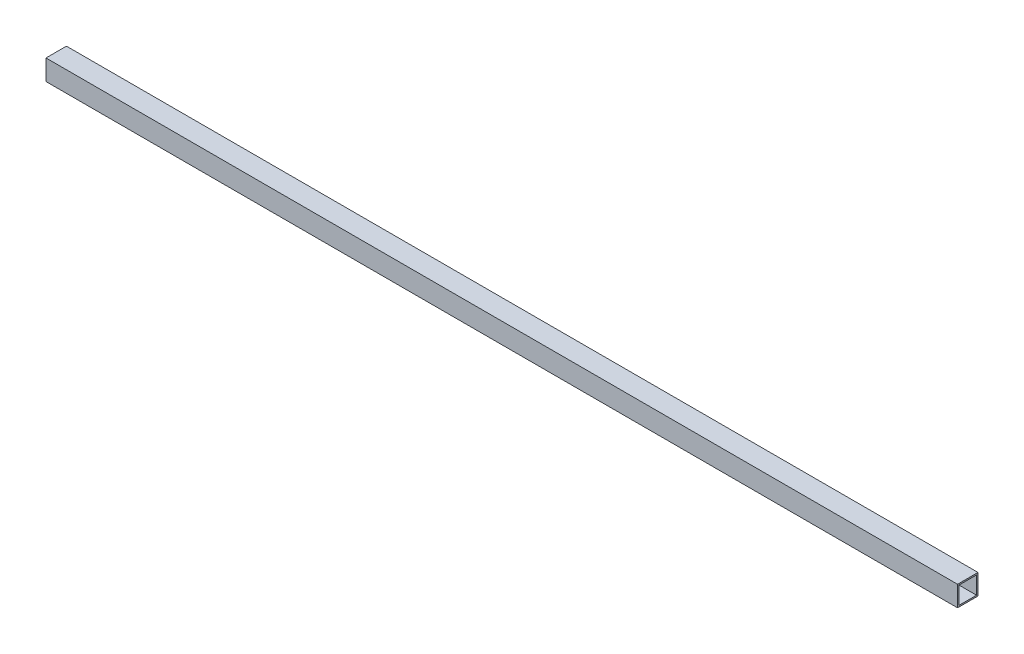
ISO-10303-21;
HEADER;
FILE_DESCRIPTION(('STEP AP214'),'2;1');
FILE_NAME('part.step','',(''),(''),'','','');
FILE_SCHEMA(('AUTOMOTIVE_DESIGN { 1 0 10303 214 1 1 1 1 }'));
ENDSEC;
DATA;
#1=APPLICATION_CONTEXT('core data for automotive mechanical design processes');
#2=APPLICATION_PROTOCOL_DEFINITION('international standard','automotive_design',2000,#1);
#3=PRODUCT_CONTEXT('',#1,'mechanical');
#4=PRODUCT('Part','Part','',(#3));
#5=PRODUCT_RELATED_PRODUCT_CATEGORY('part','',(#4));
#6=PRODUCT_DEFINITION_FORMATION('','',#4);
#7=PRODUCT_DEFINITION_CONTEXT('part definition',#1,'design');
#8=PRODUCT_DEFINITION('design','',#6,#7);
#9=PRODUCT_DEFINITION_SHAPE('','',#8);
#10=(LENGTH_UNIT() NAMED_UNIT(*) SI_UNIT(.MILLI.,.METRE.));
#11=(NAMED_UNIT(*) PLANE_ANGLE_UNIT() SI_UNIT($,.RADIAN.));
#12=(NAMED_UNIT(*) SI_UNIT($,.STERADIAN.) SOLID_ANGLE_UNIT());
#13=UNCERTAINTY_MEASURE_WITH_UNIT(LENGTH_MEASURE(1.E-05),#10,'distance_accuracy_value','');
#14=(GEOMETRIC_REPRESENTATION_CONTEXT(3) GLOBAL_UNCERTAINTY_ASSIGNED_CONTEXT((#13)) GLOBAL_UNIT_ASSIGNED_CONTEXT((#10,
#11,#12)) REPRESENTATION_CONTEXT('',''));
#15=CARTESIAN_POINT('',(0.,0.,0.));
#16=DIRECTION('',(0.,0.,1.));
#17=DIRECTION('',(1.,0.,0.));
#18=AXIS2_PLACEMENT_3D('',#15,#16,#17);
#19=CARTESIAN_POINT('',(990.6,0.,0.));
#20=DIRECTION('',(1.,0.,0.));
#21=DIRECTION('',(0.,0.,-1.));
#22=AXIS2_PLACEMENT_3D('',#19,#20,#21);
#23=PLANE('',#22);
#24=DIRECTION('',(0.,-1.,0.));
#25=VECTOR('',#24,1.);
#26=CARTESIAN_POINT('',(990.6,44.45,0.));
#27=LINE('',#26,#25);
#28=CARTESIAN_POINT('',(990.6,44.45,0.));
#29=VERTEX_POINT('',#28);
#30=CARTESIAN_POINT('',(990.6,0.,0.));
#31=VERTEX_POINT('',#30);
#32=EDGE_CURVE('E136',#29,#31,#27,.T.);
#33=ORIENTED_EDGE('',*,*,#32,.T.);
#34=DIRECTION('',(0.,0.,-1.));
#35=VECTOR('',#34,1.);
#36=CARTESIAN_POINT('',(990.6,0.,0.));
#37=LINE('',#36,#35);
#38=CARTESIAN_POINT('',(990.6,0.,-44.45));
#39=VERTEX_POINT('',#38);
#40=EDGE_CURVE('E139',#31,#39,#37,.T.);
#41=ORIENTED_EDGE('',*,*,#40,.T.);
#42=DIRECTION('',(0.,1.,0.));
#43=VECTOR('',#42,1.);
#44=CARTESIAN_POINT('',(990.6,0.,-44.45));
#45=LINE('',#44,#43);
#46=CARTESIAN_POINT('',(990.6,44.45,-44.45));
#47=VERTEX_POINT('',#46);
#48=EDGE_CURVE('E142',#39,#47,#45,.T.);
#49=ORIENTED_EDGE('',*,*,#48,.T.);
#50=DIRECTION('',(0.,0.,1.));
#51=VECTOR('',#50,1.);
#52=CARTESIAN_POINT('',(990.6,44.45,-44.45));
#53=LINE('',#52,#51);
#54=EDGE_CURVE('E144',#47,#29,#53,.T.);
#55=ORIENTED_EDGE('',*,*,#54,.T.);
#56=EDGE_LOOP('',(#33,#41,#49,#55));
#57=FACE_BOUND('',#56,.T.);
#58=DIRECTION('',(0.,0.,1.));
#59=VECTOR('',#58,1.);
#60=CARTESIAN_POINT('',(990.6,41.275,-41.275));
#61=LINE('',#60,#59);
#62=CARTESIAN_POINT('',(990.6,41.275,-41.275));
#63=VERTEX_POINT('',#62);
#64=CARTESIAN_POINT('',(990.6,41.275,-3.175));
#65=VERTEX_POINT('',#64);
#66=EDGE_CURVE('E108',#63,#65,#61,.T.);
#67=ORIENTED_EDGE('',*,*,#66,.F.);
#68=DIRECTION('',(0.,1.,0.));
#69=VECTOR('',#68,1.);
#70=CARTESIAN_POINT('',(990.6,3.175,-41.275));
#71=LINE('',#70,#69);
#72=CARTESIAN_POINT('',(990.6,3.175,-41.275));
#73=VERTEX_POINT('',#72);
#74=EDGE_CURVE('E100',#73,#63,#71,.T.);
#75=ORIENTED_EDGE('',*,*,#74,.F.);
#76=DIRECTION('',(0.,0.,-1.));
#77=VECTOR('',#76,1.);
#78=CARTESIAN_POINT('',(990.6,3.175,-3.17500000000001));
#79=LINE('',#78,#77);
#80=CARTESIAN_POINT('',(990.6,3.175,-3.17500000000001));
#81=VERTEX_POINT('',#80);
#82=EDGE_CURVE('E122',#81,#73,#79,.T.);
#83=ORIENTED_EDGE('',*,*,#82,.F.);
#84=DIRECTION('',(0.,-1.,0.));
#85=VECTOR('',#84,1.);
#86=CARTESIAN_POINT('',(990.6,41.275,-3.175));
#87=LINE('',#86,#85);
#88=EDGE_CURVE('E120',#65,#81,#87,.T.);
#89=ORIENTED_EDGE('',*,*,#88,.F.);
#90=EDGE_LOOP('',(#67,#75,#83,#89));
#91=FACE_BOUND('',#90,.T.);
#92=ADVANCED_FACE('F35',(#57,#91),#23,.T.);
#93=CARTESIAN_POINT('',(-990.6,0.,0.));
#94=DIRECTION('',(1.,0.,0.));
#95=DIRECTION('',(0.,0.,-1.));
#96=AXIS2_PLACEMENT_3D('',#93,#94,#95);
#97=PLANE('',#96);
#98=DIRECTION('',(0.,-1.,0.));
#99=VECTOR('',#98,1.);
#100=CARTESIAN_POINT('',(-990.6,44.45,0.));
#101=LINE('',#100,#99);
#102=CARTESIAN_POINT('',(-990.6,44.45,0.));
#103=VERTEX_POINT('',#102);
#104=CARTESIAN_POINT('',(-990.6,0.,0.));
#105=VERTEX_POINT('',#104);
#106=EDGE_CURVE('E116',#103,#105,#101,.T.);
#107=ORIENTED_EDGE('',*,*,#106,.F.);
#108=DIRECTION('',(0.,0.,1.));
#109=VECTOR('',#108,1.);
#110=CARTESIAN_POINT('',(-990.6,44.45,-44.45));
#111=LINE('',#110,#109);
#112=CARTESIAN_POINT('',(-990.6,44.45,-44.45));
#113=VERTEX_POINT('',#112);
#114=EDGE_CURVE('E140',#113,#103,#111,.T.);
#115=ORIENTED_EDGE('',*,*,#114,.F.);
#116=DIRECTION('',(0.,1.,0.));
#117=VECTOR('',#116,1.);
#118=CARTESIAN_POINT('',(-990.6,0.,-44.45));
#119=LINE('',#118,#117);
#120=CARTESIAN_POINT('',(-990.6,0.,-44.45));
#121=VERTEX_POINT('',#120);
#122=EDGE_CURVE('E151',#121,#113,#119,.T.);
#123=ORIENTED_EDGE('',*,*,#122,.F.);
#124=DIRECTION('',(0.,0.,-1.));
#125=VECTOR('',#124,1.);
#126=CARTESIAN_POINT('',(-990.6,0.,0.));
#127=LINE('',#126,#125);
#128=EDGE_CURVE('E149',#105,#121,#127,.T.);
#129=ORIENTED_EDGE('',*,*,#128,.F.);
#130=EDGE_LOOP('',(#107,#115,#123,#129));
#131=FACE_BOUND('',#130,.T.);
#132=DIRECTION('',(0.,1.,0.));
#133=VECTOR('',#132,1.);
#134=CARTESIAN_POINT('',(-990.6,3.175,-41.275));
#135=LINE('',#134,#133);
#136=CARTESIAN_POINT('',(-990.6,3.175,-41.275));
#137=VERTEX_POINT('',#136);
#138=CARTESIAN_POINT('',(-990.6,41.275,-41.275));
#139=VERTEX_POINT('',#138);
#140=EDGE_CURVE('E58',#137,#139,#135,.T.);
#141=ORIENTED_EDGE('',*,*,#140,.T.);
#142=DIRECTION('',(0.,0.,1.));
#143=VECTOR('',#142,1.);
#144=CARTESIAN_POINT('',(-990.6,41.275,-41.275));
#145=LINE('',#144,#143);
#146=CARTESIAN_POINT('',(-990.6,41.275,-3.175));
#147=VERTEX_POINT('',#146);
#148=EDGE_CURVE('E115',#139,#147,#145,.T.);
#149=ORIENTED_EDGE('',*,*,#148,.T.);
#150=DIRECTION('',(0.,-1.,0.));
#151=VECTOR('',#150,1.);
#152=CARTESIAN_POINT('',(-990.6,41.275,-3.175));
#153=LINE('',#152,#151);
#154=CARTESIAN_POINT('',(-990.6,3.175,-3.17500000000001));
#155=VERTEX_POINT('',#154);
#156=EDGE_CURVE('E128',#147,#155,#153,.T.);
#157=ORIENTED_EDGE('',*,*,#156,.T.);
#158=DIRECTION('',(0.,0.,-1.));
#159=VECTOR('',#158,1.);
#160=CARTESIAN_POINT('',(-990.6,3.175,-3.17500000000001));
#161=LINE('',#160,#159);
#162=EDGE_CURVE('E109',#155,#137,#161,.T.);
#163=ORIENTED_EDGE('',*,*,#162,.T.);
#164=EDGE_LOOP('',(#141,#149,#157,#163));
#165=FACE_BOUND('',#164,.T.);
#166=ADVANCED_FACE('F169',(#131,#165),#97,.F.);
#167=CARTESIAN_POINT('',(990.6,44.45,0.));
#168=DIRECTION('',(0.,0.,-1.));
#169=DIRECTION('',(0.,1.,0.));
#170=AXIS2_PLACEMENT_3D('',#167,#168,#169);
#171=PLANE('',#170);
#172=ORIENTED_EDGE('',*,*,#106,.T.);
#173=DIRECTION('',(-1.,0.,0.));
#174=VECTOR('',#173,1.);
#175=CARTESIAN_POINT('',(990.6,0.,0.));
#176=LINE('',#175,#174);
#177=EDGE_CURVE('E11',#31,#105,#176,.T.);
#178=ORIENTED_EDGE('',*,*,#177,.F.);
#179=ORIENTED_EDGE('',*,*,#32,.F.);
#180=DIRECTION('',(-1.,0.,0.));
#181=VECTOR('',#180,1.);
#182=CARTESIAN_POINT('',(990.6,44.45,0.));
#183=LINE('',#182,#181);
#184=EDGE_CURVE('E146',#29,#103,#183,.T.);
#185=ORIENTED_EDGE('',*,*,#184,.T.);
#186=EDGE_LOOP('',(#172,#178,#179,#185));
#187=FACE_BOUND('',#186,.T.);
#188=ADVANCED_FACE('F37',(#187),#171,.F.);
#189=CARTESIAN_POINT('',(990.6,0.,0.));
#190=DIRECTION('',(0.,1.,0.));
#191=DIRECTION('',(0.,0.,1.));
#192=AXIS2_PLACEMENT_3D('',#189,#190,#191);
#193=PLANE('',#192);
#194=ORIENTED_EDGE('',*,*,#128,.T.);
#195=DIRECTION('',(-1.,0.,0.));
#196=VECTOR('',#195,1.);
#197=CARTESIAN_POINT('',(990.6,0.,-44.45));
#198=LINE('',#197,#196);
#199=EDGE_CURVE('E43',#39,#121,#198,.T.);
#200=ORIENTED_EDGE('',*,*,#199,.F.);
#201=ORIENTED_EDGE('',*,*,#40,.F.);
#202=ORIENTED_EDGE('',*,*,#177,.T.);
#203=EDGE_LOOP('',(#194,#200,#201,#202));
#204=FACE_BOUND('',#203,.T.);
#205=ADVANCED_FACE('F179',(#204),#193,.F.);
#206=CARTESIAN_POINT('',(990.6,0.,-44.45));
#207=DIRECTION('',(0.,0.,1.));
#208=DIRECTION('',(0.,-1.,0.));
#209=AXIS2_PLACEMENT_3D('',#206,#207,#208);
#210=PLANE('',#209);
#211=ORIENTED_EDGE('',*,*,#122,.T.);
#212=DIRECTION('',(-1.,0.,0.));
#213=VECTOR('',#212,1.);
#214=CARTESIAN_POINT('',(990.6,44.45,-44.45));
#215=LINE('',#214,#213);
#216=EDGE_CURVE('E156',#47,#113,#215,.T.);
#217=ORIENTED_EDGE('',*,*,#216,.F.);
#218=ORIENTED_EDGE('',*,*,#48,.F.);
#219=ORIENTED_EDGE('',*,*,#199,.T.);
#220=EDGE_LOOP('',(#211,#217,#218,#219));
#221=FACE_BOUND('',#220,.T.);
#222=ADVANCED_FACE('F163',(#221),#210,.F.);
#223=CARTESIAN_POINT('',(990.6,44.45,-44.45));
#224=DIRECTION('',(0.,-1.,0.));
#225=DIRECTION('',(0.,0.,-1.));
#226=AXIS2_PLACEMENT_3D('',#223,#224,#225);
#227=PLANE('',#226);
#228=ORIENTED_EDGE('',*,*,#114,.T.);
#229=ORIENTED_EDGE('',*,*,#184,.F.);
#230=ORIENTED_EDGE('',*,*,#54,.F.);
#231=ORIENTED_EDGE('',*,*,#216,.T.);
#232=EDGE_LOOP('',(#228,#229,#230,#231));
#233=FACE_BOUND('',#232,.T.);
#234=ADVANCED_FACE('F173',(#233),#227,.F.);
#235=CARTESIAN_POINT('',(990.6,3.175,-41.275));
#236=DIRECTION('',(0.,0.,1.));
#237=DIRECTION('',(0.,-1.,0.));
#238=AXIS2_PLACEMENT_3D('',#235,#236,#237);
#239=PLANE('',#238);
#240=ORIENTED_EDGE('',*,*,#140,.F.);
#241=DIRECTION('',(-1.,0.,0.));
#242=VECTOR('',#241,1.);
#243=CARTESIAN_POINT('',(990.6,3.175,-41.275));
#244=LINE('',#243,#242);
#245=EDGE_CURVE('E104',#73,#137,#244,.T.);
#246=ORIENTED_EDGE('',*,*,#245,.F.);
#247=ORIENTED_EDGE('',*,*,#74,.T.);
#248=DIRECTION('',(-1.,0.,0.));
#249=VECTOR('',#248,1.);
#250=CARTESIAN_POINT('',(990.6,41.275,-41.275));
#251=LINE('',#250,#249);
#252=EDGE_CURVE('E103',#63,#139,#251,.T.);
#253=ORIENTED_EDGE('',*,*,#252,.T.);
#254=EDGE_LOOP('',(#240,#246,#247,#253));
#255=FACE_BOUND('',#254,.T.);
#256=ADVANCED_FACE('F102',(#255),#239,.T.);
#257=CARTESIAN_POINT('',(990.6,41.275,-41.275));
#258=DIRECTION('',(0.,-1.,0.));
#259=DIRECTION('',(0.,0.,-1.));
#260=AXIS2_PLACEMENT_3D('',#257,#258,#259);
#261=PLANE('',#260);
#262=ORIENTED_EDGE('',*,*,#148,.F.);
#263=ORIENTED_EDGE('',*,*,#252,.F.);
#264=ORIENTED_EDGE('',*,*,#66,.T.);
#265=DIRECTION('',(-1.,0.,0.));
#266=VECTOR('',#265,1.);
#267=CARTESIAN_POINT('',(990.6,41.275,-3.175));
#268=LINE('',#267,#266);
#269=EDGE_CURVE('E117',#65,#147,#268,.T.);
#270=ORIENTED_EDGE('',*,*,#269,.T.);
#271=EDGE_LOOP('',(#262,#263,#264,#270));
#272=FACE_BOUND('',#271,.T.);
#273=ADVANCED_FACE('F112',(#272),#261,.T.);
#274=CARTESIAN_POINT('',(990.6,41.275,-3.175));
#275=DIRECTION('',(0.,0.,-1.));
#276=DIRECTION('',(0.,1.,0.));
#277=AXIS2_PLACEMENT_3D('',#274,#275,#276);
#278=PLANE('',#277);
#279=ORIENTED_EDGE('',*,*,#156,.F.);
#280=ORIENTED_EDGE('',*,*,#269,.F.);
#281=ORIENTED_EDGE('',*,*,#88,.T.);
#282=DIRECTION('',(-1.,0.,0.));
#283=VECTOR('',#282,1.);
#284=CARTESIAN_POINT('',(990.6,3.175,-3.17500000000001));
#285=LINE('',#284,#283);
#286=EDGE_CURVE('E50',#81,#155,#285,.T.);
#287=ORIENTED_EDGE('',*,*,#286,.T.);
#288=EDGE_LOOP('',(#279,#280,#281,#287));
#289=FACE_BOUND('',#288,.T.);
#290=ADVANCED_FACE('F202',(#289),#278,.T.);
#291=CARTESIAN_POINT('',(990.6,3.175,-3.17500000000001));
#292=DIRECTION('',(0.,1.,0.));
#293=DIRECTION('',(0.,0.,1.));
#294=AXIS2_PLACEMENT_3D('',#291,#292,#293);
#295=PLANE('',#294);
#296=ORIENTED_EDGE('',*,*,#162,.F.);
#297=ORIENTED_EDGE('',*,*,#286,.F.);
#298=ORIENTED_EDGE('',*,*,#82,.T.);
#299=ORIENTED_EDGE('',*,*,#245,.T.);
#300=EDGE_LOOP('',(#296,#297,#298,#299));
#301=FACE_BOUND('',#300,.T.);
#302=ADVANCED_FACE('F206',(#301),#295,.T.);
#303=CLOSED_SHELL('',(#92,#166,#188,#205,#222,#234,#256,#273,#290,#302));
#304=MANIFOLD_SOLID_BREP('B2',#303);
#305=ADVANCED_BREP_SHAPE_REPRESENTATION('',(#18,#304),#14);
#306=SHAPE_DEFINITION_REPRESENTATION(#9,#305);
ENDSEC;
END-ISO-10303-21;
